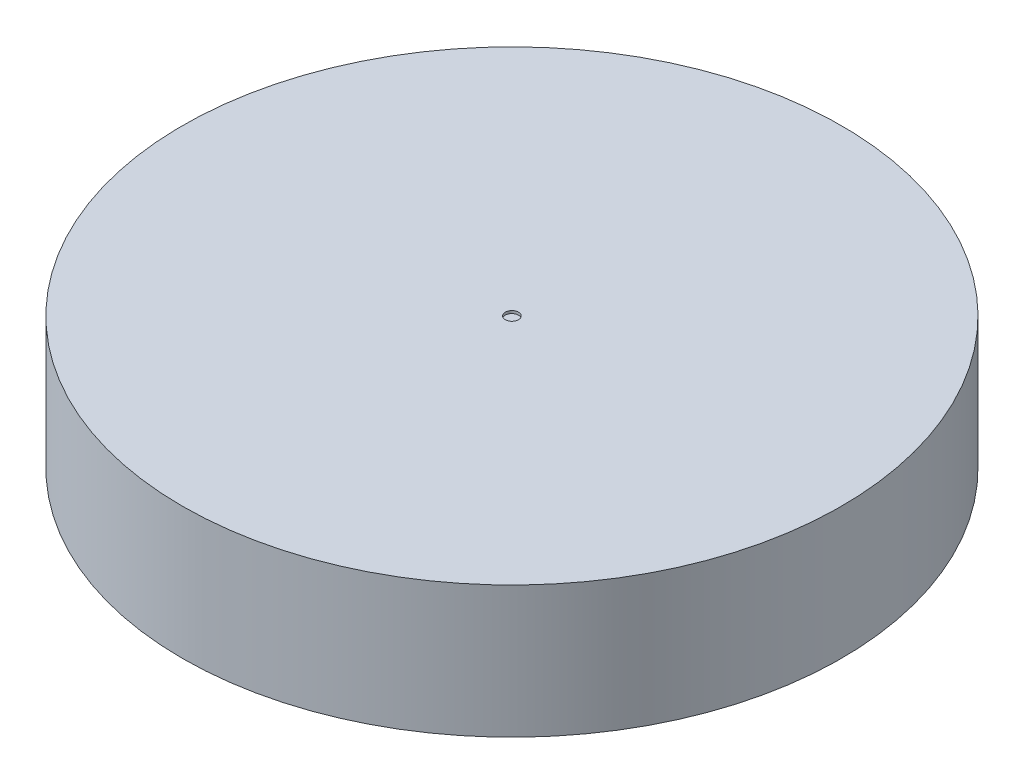
ISO-10303-21;
HEADER;
FILE_DESCRIPTION(('STEP AP214'),'2;1');
FILE_NAME('part.step','',(''),(''),'','','');
FILE_SCHEMA(('AUTOMOTIVE_DESIGN { 1 0 10303 214 1 1 1 1 }'));
ENDSEC;
DATA;
#1=APPLICATION_CONTEXT('core data for automotive mechanical design processes');
#2=APPLICATION_PROTOCOL_DEFINITION('international standard','automotive_design',2000,#1);
#3=PRODUCT_CONTEXT('',#1,'mechanical');
#4=PRODUCT('Part','Part','',(#3));
#5=PRODUCT_RELATED_PRODUCT_CATEGORY('part','',(#4));
#6=PRODUCT_DEFINITION_FORMATION('','',#4);
#7=PRODUCT_DEFINITION_CONTEXT('part definition',#1,'design');
#8=PRODUCT_DEFINITION('design','',#6,#7);
#9=PRODUCT_DEFINITION_SHAPE('','',#8);
#10=(LENGTH_UNIT() NAMED_UNIT(*) SI_UNIT(.MILLI.,.METRE.));
#11=(NAMED_UNIT(*) PLANE_ANGLE_UNIT() SI_UNIT($,.RADIAN.));
#12=(NAMED_UNIT(*) SI_UNIT($,.STERADIAN.) SOLID_ANGLE_UNIT());
#13=UNCERTAINTY_MEASURE_WITH_UNIT(LENGTH_MEASURE(1.E-05),#10,'distance_accuracy_value','');
#14=(GEOMETRIC_REPRESENTATION_CONTEXT(3) GLOBAL_UNCERTAINTY_ASSIGNED_CONTEXT((#13)) GLOBAL_UNIT_ASSIGNED_CONTEXT((#10,
#11,#12)) REPRESENTATION_CONTEXT('',''));
#15=CARTESIAN_POINT('',(0.,0.,0.));
#16=DIRECTION('',(0.,0.,1.));
#17=DIRECTION('',(1.,0.,0.));
#18=AXIS2_PLACEMENT_3D('',#15,#16,#17);
#19=CARTESIAN_POINT('',(0.,0.,0.));
#20=DIRECTION('',(0.,1.,0.));
#21=DIRECTION('',(0.,0.,1.));
#22=AXIS2_PLACEMENT_3D('',#19,#20,#21);
#23=PLANE('',#22);
#24=CARTESIAN_POINT('',(0.,0.,0.));
#25=DIRECTION('',(0.,1.,0.));
#26=DIRECTION('',(0.,0.,1.));
#27=AXIS2_PLACEMENT_3D('',#24,#25,#26);
#28=CIRCLE('',#27,25.);
#29=CARTESIAN_POINT('',(0.,0.,25.));
#30=VERTEX_POINT('',#29);
#31=EDGE_CURVE('E37',#30,#30,#28,.T.);
#32=ORIENTED_EDGE('',*,*,#31,.F.);
#33=EDGE_LOOP('',(#32));
#34=FACE_BOUND('',#33,.T.);
#35=DIRECTION('',(0.,0.,1.));
#36=VECTOR('',#35,1.);
#37=CARTESIAN_POINT('',(-5.1,0.,0.));
#38=LINE('',#37,#36);
#39=CARTESIAN_POINT('',(-5.1,0.,-2.6));
#40=VERTEX_POINT('',#39);
#41=CARTESIAN_POINT('',(-5.1,0.,2.6));
#42=VERTEX_POINT('',#41);
#43=EDGE_CURVE('E48',#40,#42,#38,.T.);
#44=ORIENTED_EDGE('',*,*,#43,.T.);
#45=DIRECTION('',(-1.,0.,0.));
#46=VECTOR('',#45,1.);
#47=CARTESIAN_POINT('',(0.,0.,2.6));
#48=LINE('',#47,#46);
#49=CARTESIAN_POINT('',(-2.6,0.,2.6));
#50=VERTEX_POINT('',#49);
#51=EDGE_CURVE('E190',#50,#42,#48,.T.);
#52=ORIENTED_EDGE('',*,*,#51,.F.);
#53=DIRECTION('',(0.,0.,1.));
#54=VECTOR('',#53,1.);
#55=CARTESIAN_POINT('',(-2.6,0.,0.));
#56=LINE('',#55,#54);
#57=CARTESIAN_POINT('',(-2.6,0.,5.1));
#58=VERTEX_POINT('',#57);
#59=EDGE_CURVE('E188',#50,#58,#56,.T.);
#60=ORIENTED_EDGE('',*,*,#59,.T.);
#61=DIRECTION('',(-1.,0.,0.));
#62=VECTOR('',#61,1.);
#63=CARTESIAN_POINT('',(0.,0.,5.1));
#64=LINE('',#63,#62);
#65=CARTESIAN_POINT('',(2.6,0.,5.1));
#66=VERTEX_POINT('',#65);
#67=EDGE_CURVE('E146',#66,#58,#64,.T.);
#68=ORIENTED_EDGE('',*,*,#67,.F.);
#69=DIRECTION('',(0.,0.,1.));
#70=VECTOR('',#69,1.);
#71=CARTESIAN_POINT('',(2.6,0.,0.));
#72=LINE('',#71,#70);
#73=CARTESIAN_POINT('',(2.6,0.,2.6));
#74=VERTEX_POINT('',#73);
#75=EDGE_CURVE('E184',#74,#66,#72,.T.);
#76=ORIENTED_EDGE('',*,*,#75,.F.);
#77=DIRECTION('',(-1.,0.,0.));
#78=VECTOR('',#77,1.);
#79=CARTESIAN_POINT('',(0.,0.,2.6));
#80=LINE('',#79,#78);
#81=CARTESIAN_POINT('',(5.1,0.,2.6));
#82=VERTEX_POINT('',#81);
#83=EDGE_CURVE('E181',#82,#74,#80,.T.);
#84=ORIENTED_EDGE('',*,*,#83,.F.);
#85=DIRECTION('',(0.,0.,1.));
#86=VECTOR('',#85,1.);
#87=CARTESIAN_POINT('',(5.1,0.,0.));
#88=LINE('',#87,#86);
#89=CARTESIAN_POINT('',(5.1,0.,-2.6));
#90=VERTEX_POINT('',#89);
#91=EDGE_CURVE('E178',#90,#82,#88,.T.);
#92=ORIENTED_EDGE('',*,*,#91,.F.);
#93=DIRECTION('',(-1.,0.,0.));
#94=VECTOR('',#93,1.);
#95=CARTESIAN_POINT('',(0.,0.,-2.6));
#96=LINE('',#95,#94);
#97=CARTESIAN_POINT('',(2.6,0.,-2.6));
#98=VERTEX_POINT('',#97);
#99=EDGE_CURVE('E175',#90,#98,#96,.T.);
#100=ORIENTED_EDGE('',*,*,#99,.T.);
#101=DIRECTION('',(0.,0.,1.));
#102=VECTOR('',#101,1.);
#103=CARTESIAN_POINT('',(2.6,0.,0.));
#104=LINE('',#103,#102);
#105=CARTESIAN_POINT('',(2.6,0.,-5.1));
#106=VERTEX_POINT('',#105);
#107=EDGE_CURVE('E172',#106,#98,#104,.T.);
#108=ORIENTED_EDGE('',*,*,#107,.F.);
#109=DIRECTION('',(-1.,0.,0.));
#110=VECTOR('',#109,1.);
#111=CARTESIAN_POINT('',(0.,0.,-5.1));
#112=LINE('',#111,#110);
#113=CARTESIAN_POINT('',(-2.6,0.,-5.1));
#114=VERTEX_POINT('',#113);
#115=EDGE_CURVE('E169',#106,#114,#112,.T.);
#116=ORIENTED_EDGE('',*,*,#115,.T.);
#117=DIRECTION('',(0.,0.,1.));
#118=VECTOR('',#117,1.);
#119=CARTESIAN_POINT('',(-2.6,0.,0.));
#120=LINE('',#119,#118);
#121=CARTESIAN_POINT('',(-2.6,0.,-2.6));
#122=VERTEX_POINT('',#121);
#123=EDGE_CURVE('E166',#114,#122,#120,.T.);
#124=ORIENTED_EDGE('',*,*,#123,.T.);
#125=DIRECTION('',(-1.,0.,0.));
#126=VECTOR('',#125,1.);
#127=CARTESIAN_POINT('',(0.,0.,-2.6));
#128=LINE('',#127,#126);
#129=EDGE_CURVE('E162',#122,#40,#128,.T.);
#130=ORIENTED_EDGE('',*,*,#129,.T.);
#131=EDGE_LOOP('',(#44,#52,#60,#68,#76,#84,#92,#100,#108,#116,#124,#130));
#132=FACE_BOUND('',#131,.T.);
#133=ADVANCED_FACE('F33',(#34,#132),#23,.F.);
#134=CARTESIAN_POINT('',(0.,10.,0.));
#135=DIRECTION('',(0.,-1.,0.));
#136=DIRECTION('',(0.,0.,-1.));
#137=AXIS2_PLACEMENT_3D('',#134,#135,#136);
#138=CYLINDRICAL_SURFACE('',#137,25.);
#139=CARTESIAN_POINT('',(0.,10.,0.));
#140=DIRECTION('',(0.,1.,0.));
#141=DIRECTION('',(0.,0.,1.));
#142=AXIS2_PLACEMENT_3D('',#139,#140,#141);
#143=CIRCLE('',#142,25.);
#144=CARTESIAN_POINT('',(0.,10.,25.));
#145=VERTEX_POINT('',#144);
#146=EDGE_CURVE('E11',#145,#145,#143,.T.);
#147=ORIENTED_EDGE('',*,*,#146,.F.);
#148=EDGE_LOOP('',(#147));
#149=FACE_BOUND('',#148,.T.);
#150=ORIENTED_EDGE('',*,*,#31,.T.);
#151=EDGE_LOOP('',(#150));
#152=FACE_BOUND('',#151,.T.);
#153=ADVANCED_FACE('F35',(#149,#152),#138,.T.);
#154=CARTESIAN_POINT('',(0.,10.,0.));
#155=DIRECTION('',(0.,1.,0.));
#156=DIRECTION('',(0.,0.,1.));
#157=AXIS2_PLACEMENT_3D('',#154,#155,#156);
#158=PLANE('',#157);
#159=CARTESIAN_POINT('',(0.,10.,0.));
#160=DIRECTION('',(0.,1.,0.));
#161=DIRECTION('',(0.,0.,1.));
#162=AXIS2_PLACEMENT_3D('',#159,#160,#161);
#163=CIRCLE('',#162,0.499999999999999);
#164=CARTESIAN_POINT('',(0.,10.,0.499999999999999));
#165=VERTEX_POINT('',#164);
#166=EDGE_CURVE('E418',#165,#165,#163,.T.);
#167=ORIENTED_EDGE('',*,*,#166,.F.);
#168=EDGE_LOOP('',(#167));
#169=FACE_BOUND('',#168,.T.);
#170=ORIENTED_EDGE('',*,*,#146,.T.);
#171=EDGE_LOOP('',(#170));
#172=FACE_BOUND('',#171,.T.);
#173=ADVANCED_FACE('F255',(#169,#172),#158,.T.);
#174=CARTESIAN_POINT('',(-5.1,6.,0.));
#175=DIRECTION('',(1.,0.,0.));
#176=DIRECTION('',(0.,0.,-1.));
#177=AXIS2_PLACEMENT_3D('',#174,#175,#176);
#178=PLANE('',#177);
#179=ORIENTED_EDGE('',*,*,#43,.F.);
#180=DIRECTION('',(0.,-1.,0.));
#181=VECTOR('',#180,1.);
#182=CARTESIAN_POINT('',(-5.1,6.,-2.6));
#183=LINE('',#182,#181);
#184=CARTESIAN_POINT('',(-5.1,6.,-2.6));
#185=VERTEX_POINT('',#184);
#186=EDGE_CURVE('E160',#185,#40,#183,.T.);
#187=ORIENTED_EDGE('',*,*,#186,.F.);
#188=DIRECTION('',(0.,0.,1.));
#189=VECTOR('',#188,1.);
#190=CARTESIAN_POINT('',(-5.1,6.,0.));
#191=LINE('',#190,#189);
#192=CARTESIAN_POINT('',(-5.1,6.,2.6));
#193=VERTEX_POINT('',#192);
#194=EDGE_CURVE('E54',#185,#193,#191,.T.);
#195=ORIENTED_EDGE('',*,*,#194,.T.);
#196=DIRECTION('',(0.,-1.,0.));
#197=VECTOR('',#196,1.);
#198=CARTESIAN_POINT('',(-5.1,6.,2.6));
#199=LINE('',#198,#197);
#200=EDGE_CURVE('E92',#193,#42,#199,.T.);
#201=ORIENTED_EDGE('',*,*,#200,.T.);
#202=EDGE_LOOP('',(#179,#187,#195,#201));
#203=FACE_BOUND('',#202,.T.);
#204=ADVANCED_FACE('F248',(#203),#178,.T.);
#205=CARTESIAN_POINT('',(0.,6.,2.6));
#206=DIRECTION('',(0.,0.,1.));
#207=DIRECTION('',(1.,0.,0.));
#208=AXIS2_PLACEMENT_3D('',#205,#206,#207);
#209=PLANE('',#208);
#210=ORIENTED_EDGE('',*,*,#51,.T.);
#211=ORIENTED_EDGE('',*,*,#200,.F.);
#212=DIRECTION('',(-1.,0.,0.));
#213=VECTOR('',#212,1.);
#214=CARTESIAN_POINT('',(0.,6.,2.6));
#215=LINE('',#214,#213);
#216=CARTESIAN_POINT('',(-2.6,6.,2.6));
#217=VERTEX_POINT('',#216);
#218=EDGE_CURVE('E138',#217,#193,#215,.T.);
#219=ORIENTED_EDGE('',*,*,#218,.F.);
#220=DIRECTION('',(0.,-1.,0.));
#221=VECTOR('',#220,1.);
#222=CARTESIAN_POINT('',(-2.6,6.,2.6));
#223=LINE('',#222,#221);
#224=EDGE_CURVE('E133',#217,#50,#223,.T.);
#225=ORIENTED_EDGE('',*,*,#224,.T.);
#226=EDGE_LOOP('',(#210,#211,#219,#225));
#227=FACE_BOUND('',#226,.T.);
#228=ADVANCED_FACE('F246',(#227),#209,.F.);
#229=CARTESIAN_POINT('',(-2.6,6.,0.));
#230=DIRECTION('',(1.,0.,0.));
#231=DIRECTION('',(0.,0.,-1.));
#232=AXIS2_PLACEMENT_3D('',#229,#230,#231);
#233=PLANE('',#232);
#234=ORIENTED_EDGE('',*,*,#59,.F.);
#235=ORIENTED_EDGE('',*,*,#224,.F.);
#236=DIRECTION('',(0.,0.,1.));
#237=VECTOR('',#236,1.);
#238=CARTESIAN_POINT('',(-2.6,6.,0.));
#239=LINE('',#238,#237);
#240=CARTESIAN_POINT('',(-2.6,6.,5.1));
#241=VERTEX_POINT('',#240);
#242=EDGE_CURVE('E127',#217,#241,#239,.T.);
#243=ORIENTED_EDGE('',*,*,#242,.T.);
#244=DIRECTION('',(0.,-1.,0.));
#245=VECTOR('',#244,1.);
#246=CARTESIAN_POINT('',(-2.6,6.,5.1));
#247=LINE('',#246,#245);
#248=EDGE_CURVE('E131',#241,#58,#247,.T.);
#249=ORIENTED_EDGE('',*,*,#248,.T.);
#250=EDGE_LOOP('',(#234,#235,#243,#249));
#251=FACE_BOUND('',#250,.T.);
#252=ADVANCED_FACE('F130',(#251),#233,.T.);
#253=CARTESIAN_POINT('',(0.,6.,5.1));
#254=DIRECTION('',(0.,0.,1.));
#255=DIRECTION('',(1.,0.,0.));
#256=AXIS2_PLACEMENT_3D('',#253,#254,#255);
#257=PLANE('',#256);
#258=ORIENTED_EDGE('',*,*,#67,.T.);
#259=ORIENTED_EDGE('',*,*,#248,.F.);
#260=DIRECTION('',(-1.,0.,0.));
#261=VECTOR('',#260,1.);
#262=CARTESIAN_POINT('',(0.,6.,5.1));
#263=LINE('',#262,#261);
#264=CARTESIAN_POINT('',(2.6,6.,5.1));
#265=VERTEX_POINT('',#264);
#266=EDGE_CURVE('E139',#265,#241,#263,.T.);
#267=ORIENTED_EDGE('',*,*,#266,.F.);
#268=DIRECTION('',(0.,-1.,0.));
#269=VECTOR('',#268,1.);
#270=CARTESIAN_POINT('',(2.6,6.,5.1));
#271=LINE('',#270,#269);
#272=EDGE_CURVE('E148',#265,#66,#271,.T.);
#273=ORIENTED_EDGE('',*,*,#272,.T.);
#274=EDGE_LOOP('',(#258,#259,#267,#273));
#275=FACE_BOUND('',#274,.T.);
#276=ADVANCED_FACE('F143',(#275),#257,.F.);
#277=CARTESIAN_POINT('',(2.6,6.,0.));
#278=DIRECTION('',(1.,0.,0.));
#279=DIRECTION('',(0.,0.,-1.));
#280=AXIS2_PLACEMENT_3D('',#277,#278,#279);
#281=PLANE('',#280);
#282=ORIENTED_EDGE('',*,*,#75,.T.);
#283=ORIENTED_EDGE('',*,*,#272,.F.);
#284=DIRECTION('',(0.,0.,1.));
#285=VECTOR('',#284,1.);
#286=CARTESIAN_POINT('',(2.6,6.,0.));
#287=LINE('',#286,#285);
#288=CARTESIAN_POINT('',(2.6,6.,2.6));
#289=VERTEX_POINT('',#288);
#290=EDGE_CURVE('E153',#289,#265,#287,.T.);
#291=ORIENTED_EDGE('',*,*,#290,.F.);
#292=DIRECTION('',(0.,-1.,0.));
#293=VECTOR('',#292,1.);
#294=CARTESIAN_POINT('',(2.6,6.,2.6));
#295=LINE('',#294,#293);
#296=EDGE_CURVE('E195',#289,#74,#295,.T.);
#297=ORIENTED_EDGE('',*,*,#296,.T.);
#298=EDGE_LOOP('',(#282,#283,#291,#297));
#299=FACE_BOUND('',#298,.T.);
#300=ADVANCED_FACE('F244',(#299),#281,.F.);
#301=CARTESIAN_POINT('',(0.,6.,2.6));
#302=DIRECTION('',(0.,0.,1.));
#303=DIRECTION('',(1.,0.,0.));
#304=AXIS2_PLACEMENT_3D('',#301,#302,#303);
#305=PLANE('',#304);
#306=ORIENTED_EDGE('',*,*,#83,.T.);
#307=ORIENTED_EDGE('',*,*,#296,.F.);
#308=DIRECTION('',(-1.,0.,0.));
#309=VECTOR('',#308,1.);
#310=CARTESIAN_POINT('',(0.,6.,2.6));
#311=LINE('',#310,#309);
#312=CARTESIAN_POINT('',(5.1,6.,2.6));
#313=VERTEX_POINT('',#312);
#314=EDGE_CURVE('E155',#313,#289,#311,.T.);
#315=ORIENTED_EDGE('',*,*,#314,.F.);
#316=DIRECTION('',(0.,-1.,0.));
#317=VECTOR('',#316,1.);
#318=CARTESIAN_POINT('',(5.1,6.,2.6));
#319=LINE('',#318,#317);
#320=EDGE_CURVE('E197',#313,#82,#319,.T.);
#321=ORIENTED_EDGE('',*,*,#320,.T.);
#322=EDGE_LOOP('',(#306,#307,#315,#321));
#323=FACE_BOUND('',#322,.T.);
#324=ADVANCED_FACE('F240',(#323),#305,.F.);
#325=CARTESIAN_POINT('',(5.1,6.,0.));
#326=DIRECTION('',(1.,0.,0.));
#327=DIRECTION('',(0.,0.,-1.));
#328=AXIS2_PLACEMENT_3D('',#325,#326,#327);
#329=PLANE('',#328);
#330=ORIENTED_EDGE('',*,*,#91,.T.);
#331=ORIENTED_EDGE('',*,*,#320,.F.);
#332=DIRECTION('',(0.,0.,1.));
#333=VECTOR('',#332,1.);
#334=CARTESIAN_POINT('',(5.1,6.,0.));
#335=LINE('',#334,#333);
#336=CARTESIAN_POINT('',(5.1,6.,-2.6));
#337=VERTEX_POINT('',#336);
#338=EDGE_CURVE('E234',#337,#313,#335,.T.);
#339=ORIENTED_EDGE('',*,*,#338,.F.);
#340=DIRECTION('',(0.,-1.,0.));
#341=VECTOR('',#340,1.);
#342=CARTESIAN_POINT('',(5.1,6.,-2.6));
#343=LINE('',#342,#341);
#344=EDGE_CURVE('E199',#337,#90,#343,.T.);
#345=ORIENTED_EDGE('',*,*,#344,.T.);
#346=EDGE_LOOP('',(#330,#331,#339,#345));
#347=FACE_BOUND('',#346,.T.);
#348=ADVANCED_FACE('F284',(#347),#329,.F.);
#349=CARTESIAN_POINT('',(0.,6.,-2.6));
#350=DIRECTION('',(0.,0.,1.));
#351=DIRECTION('',(1.,0.,0.));
#352=AXIS2_PLACEMENT_3D('',#349,#350,#351);
#353=PLANE('',#352);
#354=ORIENTED_EDGE('',*,*,#99,.F.);
#355=ORIENTED_EDGE('',*,*,#344,.F.);
#356=DIRECTION('',(-1.,0.,0.));
#357=VECTOR('',#356,1.);
#358=CARTESIAN_POINT('',(0.,6.,-2.6));
#359=LINE('',#358,#357);
#360=CARTESIAN_POINT('',(2.6,6.,-2.6));
#361=VERTEX_POINT('',#360);
#362=EDGE_CURVE('E232',#337,#361,#359,.T.);
#363=ORIENTED_EDGE('',*,*,#362,.T.);
#364=DIRECTION('',(0.,-1.,0.));
#365=VECTOR('',#364,1.);
#366=CARTESIAN_POINT('',(2.6,6.,-2.6));
#367=LINE('',#366,#365);
#368=EDGE_CURVE('E201',#361,#98,#367,.T.);
#369=ORIENTED_EDGE('',*,*,#368,.T.);
#370=EDGE_LOOP('',(#354,#355,#363,#369));
#371=FACE_BOUND('',#370,.T.);
#372=ADVANCED_FACE('F280',(#371),#353,.T.);
#373=CARTESIAN_POINT('',(2.6,6.,0.));
#374=DIRECTION('',(1.,0.,0.));
#375=DIRECTION('',(0.,0.,-1.));
#376=AXIS2_PLACEMENT_3D('',#373,#374,#375);
#377=PLANE('',#376);
#378=ORIENTED_EDGE('',*,*,#107,.T.);
#379=ORIENTED_EDGE('',*,*,#368,.F.);
#380=DIRECTION('',(0.,0.,1.));
#381=VECTOR('',#380,1.);
#382=CARTESIAN_POINT('',(2.6,6.,0.));
#383=LINE('',#382,#381);
#384=CARTESIAN_POINT('',(2.6,6.,-5.1));
#385=VERTEX_POINT('',#384);
#386=EDGE_CURVE('E229',#385,#361,#383,.T.);
#387=ORIENTED_EDGE('',*,*,#386,.F.);
#388=DIRECTION('',(0.,-1.,0.));
#389=VECTOR('',#388,1.);
#390=CARTESIAN_POINT('',(2.6,6.,-5.1));
#391=LINE('',#390,#389);
#392=EDGE_CURVE('E203',#385,#106,#391,.T.);
#393=ORIENTED_EDGE('',*,*,#392,.T.);
#394=EDGE_LOOP('',(#378,#379,#387,#393));
#395=FACE_BOUND('',#394,.T.);
#396=ADVANCED_FACE('F276',(#395),#377,.F.);
#397=CARTESIAN_POINT('',(0.,6.,-5.1));
#398=DIRECTION('',(0.,0.,1.));
#399=DIRECTION('',(1.,0.,0.));
#400=AXIS2_PLACEMENT_3D('',#397,#398,#399);
#401=PLANE('',#400);
#402=ORIENTED_EDGE('',*,*,#115,.F.);
#403=ORIENTED_EDGE('',*,*,#392,.F.);
#404=DIRECTION('',(-1.,0.,0.));
#405=VECTOR('',#404,1.);
#406=CARTESIAN_POINT('',(0.,6.,-5.1));
#407=LINE('',#406,#405);
#408=CARTESIAN_POINT('',(-2.6,6.,-5.1));
#409=VERTEX_POINT('',#408);
#410=EDGE_CURVE('E223',#385,#409,#407,.T.);
#411=ORIENTED_EDGE('',*,*,#410,.T.);
#412=DIRECTION('',(0.,-1.,0.));
#413=VECTOR('',#412,1.);
#414=CARTESIAN_POINT('',(-2.6,6.,-5.1));
#415=LINE('',#414,#413);
#416=EDGE_CURVE('E205',#409,#114,#415,.T.);
#417=ORIENTED_EDGE('',*,*,#416,.T.);
#418=EDGE_LOOP('',(#402,#403,#411,#417));
#419=FACE_BOUND('',#418,.T.);
#420=ADVANCED_FACE('F273',(#419),#401,.T.);
#421=CARTESIAN_POINT('',(-2.6,6.,0.));
#422=DIRECTION('',(1.,0.,0.));
#423=DIRECTION('',(0.,0.,-1.));
#424=AXIS2_PLACEMENT_3D('',#421,#422,#423);
#425=PLANE('',#424);
#426=ORIENTED_EDGE('',*,*,#123,.F.);
#427=ORIENTED_EDGE('',*,*,#416,.F.);
#428=DIRECTION('',(0.,0.,1.));
#429=VECTOR('',#428,1.);
#430=CARTESIAN_POINT('',(-2.6,6.,0.));
#431=LINE('',#430,#429);
#432=CARTESIAN_POINT('',(-2.6,6.,-2.6));
#433=VERTEX_POINT('',#432);
#434=EDGE_CURVE('E220',#409,#433,#431,.T.);
#435=ORIENTED_EDGE('',*,*,#434,.T.);
#436=DIRECTION('',(0.,-1.,0.));
#437=VECTOR('',#436,1.);
#438=CARTESIAN_POINT('',(-2.6,6.,-2.6));
#439=LINE('',#438,#437);
#440=EDGE_CURVE('E207',#433,#122,#439,.T.);
#441=ORIENTED_EDGE('',*,*,#440,.T.);
#442=EDGE_LOOP('',(#426,#427,#435,#441));
#443=FACE_BOUND('',#442,.T.);
#444=ADVANCED_FACE('F218',(#443),#425,.T.);
#445=CARTESIAN_POINT('',(0.,6.,-2.6));
#446=DIRECTION('',(0.,0.,1.));
#447=DIRECTION('',(1.,0.,0.));
#448=AXIS2_PLACEMENT_3D('',#445,#446,#447);
#449=PLANE('',#448);
#450=ORIENTED_EDGE('',*,*,#129,.F.);
#451=ORIENTED_EDGE('',*,*,#440,.F.);
#452=DIRECTION('',(-1.,0.,0.));
#453=VECTOR('',#452,1.);
#454=CARTESIAN_POINT('',(0.,6.,-2.6));
#455=LINE('',#454,#453);
#456=EDGE_CURVE('E100',#433,#185,#455,.T.);
#457=ORIENTED_EDGE('',*,*,#456,.T.);
#458=ORIENTED_EDGE('',*,*,#186,.T.);
#459=EDGE_LOOP('',(#450,#451,#457,#458));
#460=FACE_BOUND('',#459,.T.);
#461=ADVANCED_FACE('F210',(#460),#449,.T.);
#462=CARTESIAN_POINT('',(0.,6.,0.));
#463=DIRECTION('',(0.,-1.,0.));
#464=DIRECTION('',(0.,0.,-1.));
#465=AXIS2_PLACEMENT_3D('',#462,#463,#464);
#466=PLANE('',#465);
#467=ORIENTED_EDGE('',*,*,#194,.F.);
#468=ORIENTED_EDGE('',*,*,#456,.F.);
#469=ORIENTED_EDGE('',*,*,#434,.F.);
#470=ORIENTED_EDGE('',*,*,#410,.F.);
#471=ORIENTED_EDGE('',*,*,#386,.T.);
#472=ORIENTED_EDGE('',*,*,#362,.F.);
#473=ORIENTED_EDGE('',*,*,#338,.T.);
#474=ORIENTED_EDGE('',*,*,#314,.T.);
#475=ORIENTED_EDGE('',*,*,#290,.T.);
#476=ORIENTED_EDGE('',*,*,#266,.T.);
#477=ORIENTED_EDGE('',*,*,#242,.F.);
#478=ORIENTED_EDGE('',*,*,#218,.T.);
#479=EDGE_LOOP('',(#467,#468,#469,#470,#471,#472,#473,#474,#475,#476,#477,#478));
#480=FACE_BOUND('',#479,.T.);
#481=ADVANCED_FACE('F150',(#480),#466,.T.);
#482=CARTESIAN_POINT('',(0.,9.8,0.));
#483=DIRECTION('',(0.,1.,0.));
#484=DIRECTION('',(0.,0.,1.));
#485=AXIS2_PLACEMENT_3D('',#482,#483,#484);
#486=CYLINDRICAL_SURFACE('',#485,0.499999999999999);
#487=CARTESIAN_POINT('',(0.,9.8,0.));
#488=DIRECTION('',(0.,1.,0.));
#489=DIRECTION('',(0.,0.,1.));
#490=AXIS2_PLACEMENT_3D('',#487,#488,#489);
#491=CIRCLE('',#490,0.499999999999999);
#492=CARTESIAN_POINT('',(0.,9.8,0.499999999999999));
#493=VERTEX_POINT('',#492);
#494=EDGE_CURVE('E163',#493,#493,#491,.T.);
#495=ORIENTED_EDGE('',*,*,#494,.F.);
#496=EDGE_LOOP('',(#495));
#497=FACE_BOUND('',#496,.T.);
#498=ORIENTED_EDGE('',*,*,#166,.T.);
#499=EDGE_LOOP('',(#498));
#500=FACE_BOUND('',#499,.T.);
#501=ADVANCED_FACE('F336',(#497,#500),#486,.F.);
#502=CARTESIAN_POINT('',(0.,9.8,0.));
#503=DIRECTION('',(0.,1.,0.));
#504=DIRECTION('',(0.,0.,1.));
#505=AXIS2_PLACEMENT_3D('',#502,#503,#504);
#506=PLANE('',#505);
#507=ORIENTED_EDGE('',*,*,#494,.T.);
#508=EDGE_LOOP('',(#507));
#509=FACE_BOUND('',#508,.T.);
#510=ADVANCED_FACE('F343',(#509),#506,.T.);
#511=CLOSED_SHELL('',(#133,#153,#173,#204,#228,#252,#276,#300,#324,#348,#372,#396,#420,#444,
#461,#481,#501,#510));
#512=MANIFOLD_SOLID_BREP('B2',#511);
#513=ADVANCED_BREP_SHAPE_REPRESENTATION('',(#18,#512),#14);
#514=SHAPE_DEFINITION_REPRESENTATION(#9,#513);
ENDSEC;
END-ISO-10303-21;
